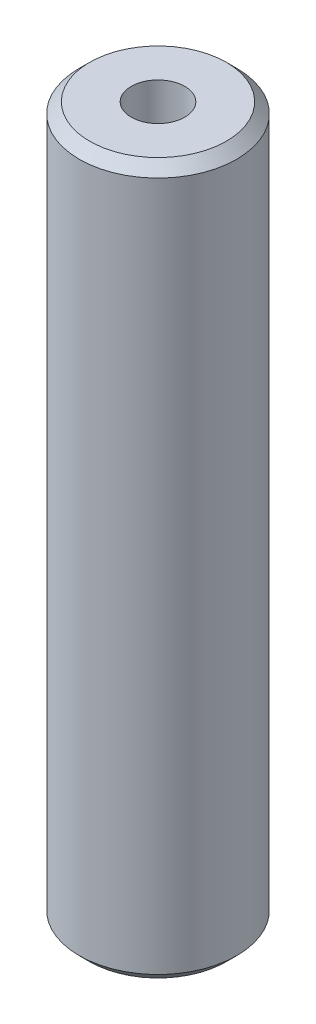
ISO-10303-21;
HEADER;
FILE_DESCRIPTION(('STEP AP214'),'2;1');
FILE_NAME('part.step','',(''),(''),'','','');
FILE_SCHEMA(('AUTOMOTIVE_DESIGN { 1 0 10303 214 1 1 1 1 }'));
ENDSEC;
DATA;
#1=APPLICATION_CONTEXT('core data for automotive mechanical design processes');
#2=APPLICATION_PROTOCOL_DEFINITION('international standard','automotive_design',2000,#1);
#3=PRODUCT_CONTEXT('',#1,'mechanical');
#4=PRODUCT('Part','Part','',(#3));
#5=PRODUCT_RELATED_PRODUCT_CATEGORY('part','',(#4));
#6=PRODUCT_DEFINITION_FORMATION('','',#4);
#7=PRODUCT_DEFINITION_CONTEXT('part definition',#1,'design');
#8=PRODUCT_DEFINITION('design','',#6,#7);
#9=PRODUCT_DEFINITION_SHAPE('','',#8);
#10=(LENGTH_UNIT() NAMED_UNIT(*) SI_UNIT(.MILLI.,.METRE.));
#11=(NAMED_UNIT(*) PLANE_ANGLE_UNIT() SI_UNIT($,.RADIAN.));
#12=(NAMED_UNIT(*) SI_UNIT($,.STERADIAN.) SOLID_ANGLE_UNIT());
#13=UNCERTAINTY_MEASURE_WITH_UNIT(LENGTH_MEASURE(1.E-05),#10,'distance_accuracy_value','');
#14=(GEOMETRIC_REPRESENTATION_CONTEXT(3) GLOBAL_UNCERTAINTY_ASSIGNED_CONTEXT((#13)) GLOBAL_UNIT_ASSIGNED_CONTEXT((#10,
#11,#12)) REPRESENTATION_CONTEXT('',''));
#15=CARTESIAN_POINT('',(0.,0.,0.));
#16=DIRECTION('',(0.,0.,1.));
#17=DIRECTION('',(1.,0.,0.));
#18=AXIS2_PLACEMENT_3D('',#15,#16,#17);
#19=CARTESIAN_POINT('',(0.,383.328716124654,0.));
#20=DIRECTION('',(0.,-1.,0.));
#21=DIRECTION('',(0.,0.,-1.));
#22=AXIS2_PLACEMENT_3D('',#19,#20,#21);
#23=CYLINDRICAL_SURFACE('',#22,42.5);
#24=CARTESIAN_POINT('',(0.,377.711191490989,0.));
#25=DIRECTION('',(0.,1.,0.));
#26=DIRECTION('',(0.,0.,1.));
#27=AXIS2_PLACEMENT_3D('',#24,#25,#26);
#28=CIRCLE('',#27,42.5);
#29=CARTESIAN_POINT('',(0.,377.711191490989,-42.5));
#30=VERTEX_POINT('',#29);
#31=EDGE_CURVE('E50',#30,#30,#28,.F.);
#32=CARTESIAN_POINT('',(0.,5.61752463366483,0.));
#33=DIRECTION('',(0.,1.,0.));
#34=DIRECTION('',(0.,0.,1.));
#35=AXIS2_PLACEMENT_3D('',#32,#33,#34);
#36=CIRCLE('',#35,42.5);
#37=CARTESIAN_POINT('',(0.,5.61752463366477,-42.5));
#38=VERTEX_POINT('',#37);
#39=EDGE_CURVE('E51',#38,#38,#36,.T.);
#40=CARTESIAN_POINT('',(0.,377.711191490989,-42.5));
#41=CARTESIAN_POINT('',(0.,373.835215794558,-42.5));
#42=CARTESIAN_POINT('',(0.,369.959240098128,-42.5));
#43=CARTESIAN_POINT('',(0.,362.207288705267,-42.5));
#44=CARTESIAN_POINT('',(0.,358.331313008837,-42.5));
#45=CARTESIAN_POINT('',(0.,350.579361615976,-42.5));
#46=CARTESIAN_POINT('',(0.,346.703385919545,-42.5));
#47=CARTESIAN_POINT('',(0.,338.951434526684,-42.5));
#48=CARTESIAN_POINT('',(0.,335.075458830254,-42.5));
#49=CARTESIAN_POINT('',(0.,327.323507437393,-42.5));
#50=CARTESIAN_POINT('',(0.,323.447531740962,-42.5));
#51=CARTESIAN_POINT('',(0.,315.695580348102,-42.5));
#52=CARTESIAN_POINT('',(0.,311.819604651671,-42.5));
#53=CARTESIAN_POINT('',(0.,304.06765325881,-42.5));
#54=CARTESIAN_POINT('',(0.,300.19167756238,-42.5));
#55=CARTESIAN_POINT('',(0.,292.439726169519,-42.5));
#56=CARTESIAN_POINT('',(0.,288.563750473088,-42.5));
#57=CARTESIAN_POINT('',(0.,280.811799080227,-42.5));
#58=CARTESIAN_POINT('',(0.,276.935823383797,-42.5));
#59=CARTESIAN_POINT('',(0.,269.183871990936,-42.5));
#60=CARTESIAN_POINT('',(0.,265.307896294505,-42.5));
#61=CARTESIAN_POINT('',(0.,257.555944901645,-42.5));
#62=CARTESIAN_POINT('',(0.,253.679969205214,-42.5));
#63=CARTESIAN_POINT('',(0.,245.928017812353,-42.5));
#64=CARTESIAN_POINT('',(0.,242.052042115923,-42.5));
#65=CARTESIAN_POINT('',(0.,234.300090723062,-42.5));
#66=CARTESIAN_POINT('',(0.,230.424115026631,-42.5));
#67=CARTESIAN_POINT('',(0.,222.67216363377,-42.5));
#68=CARTESIAN_POINT('',(0.,218.79618793734,-42.5));
#69=CARTESIAN_POINT('',(0.,211.044236544479,-42.5));
#70=CARTESIAN_POINT('',(0.,207.168260848049,-42.5));
#71=CARTESIAN_POINT('',(0.,199.416309455188,-42.5));
#72=CARTESIAN_POINT('',(0.,195.540333758757,-42.5));
#73=CARTESIAN_POINT('',(0.,187.788382365896,-42.5));
#74=CARTESIAN_POINT('',(0.,183.912406669466,-42.5));
#75=CARTESIAN_POINT('',(0.,176.160455276605,-42.5));
#76=CARTESIAN_POINT('',(0.,172.284479580175,-42.5));
#77=CARTESIAN_POINT('',(0.,164.532528187314,-42.5));
#78=CARTESIAN_POINT('',(0.,160.656552490883,-42.5));
#79=CARTESIAN_POINT('',(0.,152.904601098022,-42.5));
#80=CARTESIAN_POINT('',(0.,149.028625401592,-42.5));
#81=CARTESIAN_POINT('',(0.,141.276674008731,-42.5));
#82=CARTESIAN_POINT('',(0.,137.4006983123,-42.5));
#83=CARTESIAN_POINT('',(0.,129.648746919439,-42.5));
#84=CARTESIAN_POINT('',(0.,125.772771223009,-42.5));
#85=CARTESIAN_POINT('',(0.,118.020819830148,-42.5));
#86=CARTESIAN_POINT('',(0.,114.144844133718,-42.5));
#87=CARTESIAN_POINT('',(0.,106.392892740857,-42.5));
#88=CARTESIAN_POINT('',(0.,102.516917044426,-42.5));
#89=CARTESIAN_POINT('',(0.,94.7649656515653,-42.5));
#90=CARTESIAN_POINT('',(0.,90.8889899551348,-42.5));
#91=CARTESIAN_POINT('',(0.,83.1370385622739,-42.5));
#92=CARTESIAN_POINT('',(0.,79.2610628658435,-42.5));
#93=CARTESIAN_POINT('',(0.,71.5091114729825,-42.5));
#94=CARTESIAN_POINT('',(0.,67.6331357765521,-42.5));
#95=CARTESIAN_POINT('',(0.,59.8811843836911,-42.5));
#96=CARTESIAN_POINT('',(0.,56.0052086872607,-42.5));
#97=CARTESIAN_POINT('',(0.,48.2532572943998,-42.5));
#98=CARTESIAN_POINT('',(0.,44.3772815979693,-42.5));
#99=CARTESIAN_POINT('',(0.,36.6253302051084,-42.5));
#100=CARTESIAN_POINT('',(0.,32.749354508678,-42.5));
#101=CARTESIAN_POINT('',(0.,24.9974031158171,-42.5));
#102=CARTESIAN_POINT('',(0.,21.1214274193866,-42.5));
#103=CARTESIAN_POINT('',(0.,13.3694760265257,-42.5));
#104=CARTESIAN_POINT('',(0.,9.49350033009524,-42.5));
#105=CARTESIAN_POINT('',(0.,5.61752463366477,-42.5));
#106=B_SPLINE_CURVE_WITH_KNOTS('',3,(#40,#41,#42,#43,#44,#45,#46,#47,#48,#49,#50,#51,#52,#53,
#54,#55,#56,#57,#58,#59,#60,#61,#62,#63,#64,#65,#66,#67,#68,#69,#70,#71,#72,#73,#74,#75,#76,#77,
#78,#79,#80,#81,#82,#83,#84,#85,#86,#87,#88,#89,#90,#91,#92,#93,#94,#95,#96,#97,#98,#99,#100,
#101,#102,#103,#104,#105),.UNSPECIFIED.,.F.,.F.,(4,2,2,2,2,2,2,2,2,2,2,2,2,2,2,2,2,2,2,2,2,2,2,
2,2,2,2,2,2,2,2,2,4),(0.,11.6279270892913,23.2558541785827,34.8837812678741,46.5117083571655,
58.1396354464568,69.7675625357482,81.3954896250396,93.023416714331,104.651343803622,
116.279270892914,127.907197982205,139.535125071497,151.163052160788,162.790979250079,
174.418906339371,186.046833428662,197.674760517953,209.302687607245,220.930614696536,
232.558541785828,244.186468875119,255.81439596441,267.442323053702,279.070250142993,
290.698177232284,302.326104321576,313.954031410867,325.581958500159,337.20988558945,
348.837812678741,360.465739768033,372.093666857324),.UNSPECIFIED.);
#107=EDGE_CURVE('BSEAM39',#30,#38,#106,.T.);
#108=ORIENTED_EDGE('',*,*,#31,.T.);
#109=ORIENTED_EDGE('',*,*,#39,.T.);
#110=ORIENTED_EDGE('',*,*,#107,.T.);
#111=ORIENTED_EDGE('',*,*,#107,.F.);
#112=EDGE_LOOP('',(#108,#110,#109,#111));
#113=FACE_BOUND('',#112,.T.);
#114=ADVANCED_FACE('F39',(#113),#23,.T.);
#115=CARTESIAN_POINT('',(0.,383.328716124654,0.));
#116=DIRECTION('',(0.,1.,0.));
#117=DIRECTION('',(0.,0.,1.));
#118=AXIS2_PLACEMENT_3D('',#115,#116,#117);
#119=PLANE('',#118);
#120=CARTESIAN_POINT('',(0.,383.328716124654,0.));
#121=DIRECTION('',(0.,1.,0.));
#122=DIRECTION('',(0.,0.,1.));
#123=AXIS2_PLACEMENT_3D('',#120,#121,#122);
#124=CIRCLE('',#123,36.8824753663352);
#125=CARTESIAN_POINT('',(0.,383.328716124654,-36.8824753663352));
#126=VERTEX_POINT('',#125);
#127=EDGE_CURVE('E54',#126,#126,#124,.T.);
#128=ORIENTED_EDGE('',*,*,#127,.T.);
#129=EDGE_LOOP('',(#128));
#130=FACE_BOUND('',#129,.T.);
#131=CARTESIAN_POINT('',(0.,383.328716124654,0.));
#132=DIRECTION('',(0.,1.,0.));
#133=DIRECTION('',(0.,0.,1.));
#134=AXIS2_PLACEMENT_3D('',#131,#132,#133);
#135=CIRCLE('',#134,14.4369700554895);
#136=CARTESIAN_POINT('',(0.,383.328716124654,14.4369700554895));
#137=VERTEX_POINT('',#136);
#138=EDGE_CURVE('E58',#137,#137,#135,.T.);
#139=ORIENTED_EDGE('',*,*,#138,.F.);
#140=EDGE_LOOP('',(#139));
#141=FACE_BOUND('',#140,.T.);
#142=ADVANCED_FACE('F69',(#130,#141),#119,.T.);
#143=CARTESIAN_POINT('',(0.,0.,0.));
#144=DIRECTION('',(0.,1.,0.));
#145=DIRECTION('',(0.,0.,1.));
#146=AXIS2_PLACEMENT_3D('',#143,#144,#145);
#147=PLANE('',#146);
#148=CARTESIAN_POINT('',(0.,0.,0.));
#149=DIRECTION('',(0.,1.,0.));
#150=DIRECTION('',(0.,0.,1.));
#151=AXIS2_PLACEMENT_3D('',#148,#149,#150);
#152=CIRCLE('',#151,36.8824753663351);
#153=CARTESIAN_POINT('',(0.,0.,36.8824753663351));
#154=VERTEX_POINT('',#153);
#155=EDGE_CURVE('E10',#154,#154,#152,.F.);
#156=ORIENTED_EDGE('',*,*,#155,.T.);
#157=EDGE_LOOP('',(#156));
#158=FACE_BOUND('',#157,.T.);
#159=CARTESIAN_POINT('',(0.,0.,0.));
#160=DIRECTION('',(0.,1.,0.));
#161=DIRECTION('',(0.,0.,1.));
#162=AXIS2_PLACEMENT_3D('',#159,#160,#161);
#163=CIRCLE('',#162,14.4369700554895);
#164=CARTESIAN_POINT('',(0.,0.,14.4369700554895));
#165=VERTEX_POINT('',#164);
#166=EDGE_CURVE('E63',#165,#165,#163,.T.);
#167=ORIENTED_EDGE('',*,*,#166,.T.);
#168=EDGE_LOOP('',(#167));
#169=FACE_BOUND('',#168,.T.);
#170=ADVANCED_FACE('F75',(#158,#169),#147,.F.);
#171=CARTESIAN_POINT('',(0.,383.328716124654,0.));
#172=DIRECTION('',(0.,-1.,0.));
#173=DIRECTION('',(0.,0.,-1.));
#174=AXIS2_PLACEMENT_3D('',#171,#172,#173);
#175=CYLINDRICAL_SURFACE('',#174,14.4369700554895);
#176=ORIENTED_EDGE('',*,*,#138,.T.);
#177=EDGE_LOOP('',(#176));
#178=FACE_BOUND('',#177,.T.);
#179=ORIENTED_EDGE('',*,*,#166,.F.);
#180=EDGE_LOOP('',(#179));
#181=FACE_BOUND('',#180,.T.);
#182=ADVANCED_FACE('F70',(#178,#181),#175,.F.);
#183=CARTESIAN_POINT('',(0.,383.328716124654,0.));
#184=DIRECTION('',(0.,-1.,0.));
#185=DIRECTION('',(0.,0.,-1.));
#186=AXIS2_PLACEMENT_3D('',#183,#184,#185);
#187=CONICAL_SURFACE('',#186,36.8824753663352,0.785398163397446);
#188=CARTESIAN_POINT('',(0.,377.711191490989,-42.5));
#189=CARTESIAN_POINT('',(0.,377.76970737259,-42.4414841183994));
#190=CARTESIAN_POINT('',(0.,377.82822325419,-42.3829682367987));
#191=CARTESIAN_POINT('',(0.,377.945255017392,-42.2659364735973));
#192=CARTESIAN_POINT('',(0.,378.003770898992,-42.2074205919967));
#193=CARTESIAN_POINT('',(0.,378.120802662194,-42.0903888287953));
#194=CARTESIAN_POINT('',(0.,378.179318543794,-42.0318729471946));
#195=CARTESIAN_POINT('',(0.,378.296350306996,-41.9148411839933));
#196=CARTESIAN_POINT('',(0.,378.354866188596,-41.8563253023926));
#197=CARTESIAN_POINT('',(0.,378.471897951798,-41.7392935391913));
#198=CARTESIAN_POINT('',(0.,378.530413833398,-41.6807776575906));
#199=CARTESIAN_POINT('',(0.,378.6474455966,-41.5637458943892));
#200=CARTESIAN_POINT('',(0.,378.7059614782,-41.5052300127886));
#201=CARTESIAN_POINT('',(0.,378.822993241402,-41.3881982495872));
#202=CARTESIAN_POINT('',(0.,378.881509123002,-41.3296823679865));
#203=CARTESIAN_POINT('',(0.,378.998540886204,-41.2126506047852));
#204=CARTESIAN_POINT('',(0.,379.057056767804,-41.1541347231845));
#205=CARTESIAN_POINT('',(0.,379.174088531006,-41.0371029599832));
#206=CARTESIAN_POINT('',(0.,379.232604412606,-40.9785870783825));
#207=CARTESIAN_POINT('',(0.,379.349636175808,-40.8615553151811));
#208=CARTESIAN_POINT('',(0.,379.408152057408,-40.8030394335805));
#209=CARTESIAN_POINT('',(0.,379.52518382061,-40.6860076703791));
#210=CARTESIAN_POINT('',(0.,379.58369970221,-40.6274917887784));
#211=CARTESIAN_POINT('',(0.,379.700731465412,-40.5104600255771));
#212=CARTESIAN_POINT('',(0.,379.759247347013,-40.4519441439764));
#213=CARTESIAN_POINT('',(0.,379.876279110214,-40.3349123807751));
#214=CARTESIAN_POINT('',(0.,379.934794991815,-40.2763964991744));
#215=CARTESIAN_POINT('',(0.,380.051826755016,-40.159364735973));
#216=CARTESIAN_POINT('',(0.,380.110342636617,-40.1008488543724));
#217=CARTESIAN_POINT('',(0.,380.227374399818,-39.983817091171));
#218=CARTESIAN_POINT('',(0.,380.285890281419,-39.9253012095703));
#219=CARTESIAN_POINT('',(0.,380.40292204462,-39.808269446369));
#220=CARTESIAN_POINT('',(0.,380.461437926221,-39.7497535647683));
#221=CARTESIAN_POINT('',(0.,380.578469689422,-39.632721801567));
#222=CARTESIAN_POINT('',(0.,380.636985571023,-39.5742059199663));
#223=CARTESIAN_POINT('',(0.,380.754017334224,-39.4571741567649));
#224=CARTESIAN_POINT('',(0.,380.812533215825,-39.3986582751643));
#225=CARTESIAN_POINT('',(0.,380.929564979026,-39.2816265119629));
#226=CARTESIAN_POINT('',(0.,380.988080860627,-39.2231106303622));
#227=CARTESIAN_POINT('',(0.,381.105112623828,-39.1060788671609));
#228=CARTESIAN_POINT('',(0.,381.163628505429,-39.0475629855602));
#229=CARTESIAN_POINT('',(0.,381.28066026863,-38.9305312223589));
#230=CARTESIAN_POINT('',(0.,381.339176150231,-38.8720153407582));
#231=CARTESIAN_POINT('',(0.,381.456207913432,-38.7549835775568));
#232=CARTESIAN_POINT('',(0.,381.514723795033,-38.6964676959562));
#233=CARTESIAN_POINT('',(0.,381.631755558234,-38.5794359327548));
#234=CARTESIAN_POINT('',(0.,381.690271439835,-38.5209200511541));
#235=CARTESIAN_POINT('',(0.,381.807303203036,-38.4038882879528));
#236=CARTESIAN_POINT('',(0.,381.865819084637,-38.3453724063521));
#237=CARTESIAN_POINT('',(0.,381.982850847838,-38.2283406431508));
#238=CARTESIAN_POINT('',(0.,382.041366729439,-38.1698247615501));
#239=CARTESIAN_POINT('',(0.,382.15839849264,-38.0527929983487));
#240=CARTESIAN_POINT('',(0.,382.216914374241,-37.9942771167481));
#241=CARTESIAN_POINT('',(0.,382.333946137442,-37.8772453535467));
#242=CARTESIAN_POINT('',(0.,382.392462019043,-37.818729471946));
#243=CARTESIAN_POINT('',(0.,382.509493782244,-37.7016977087447));
#244=CARTESIAN_POINT('',(0.,382.568009663845,-37.643181827144));
#245=CARTESIAN_POINT('',(0.,382.685041427046,-37.5261500639427));
#246=CARTESIAN_POINT('',(0.,382.743557308647,-37.467634182342));
#247=CARTESIAN_POINT('',(0.,382.860589071848,-37.3506024191406));
#248=CARTESIAN_POINT('',(0.,382.919104953449,-37.29208653754));
#249=CARTESIAN_POINT('',(0.,383.03613671665,-37.1750547743386));
#250=CARTESIAN_POINT('',(0.,383.094652598251,-37.1165388927379));
#251=CARTESIAN_POINT('',(0.,383.211684361452,-36.9995071295366));
#252=CARTESIAN_POINT('',(0.,383.270200243053,-36.9409912479359));
#253=CARTESIAN_POINT('',(0.,383.328716124654,-36.8824753663352));
#254=B_SPLINE_CURVE_WITH_KNOTS('',3,(#188,#189,#190,#191,#192,#193,#194,#195,#196,#197,#198,
#199,#200,#201,#202,#203,#204,#205,#206,#207,#208,#209,#210,#211,#212,#213,#214,#215,#216,#217,
#218,#219,#220,#221,#222,#223,#224,#225,#226,#227,#228,#229,#230,#231,#232,#233,#234,#235,#236,
#237,#238,#239,#240,#241,#242,#243,#244,#245,#246,#247,#248,#249,#250,#251,#252,#253),
.UNSPECIFIED.,.F.,.F.,(4,2,2,2,2,2,2,2,2,2,2,2,2,2,2,2,2,2,2,2,2,2,2,2,2,2,2,2,2,2,2,2,4),(0.,
0.24826186012165,0.496523720243345,0.744785580365034,0.99304744048669,1.24130930060838,
1.48957116073007,1.73783302085172,1.98609488097341,2.2343567410951,2.48261860121676,
2.73088046133845,2.97914232146014,3.22740418158179,3.47566604170348,3.72392790182518,
3.97218976194687,4.22045162206852,4.46871348219021,4.7169753423119,4.96523720243356,
5.21349906255525,5.46176092267694,5.71002278279859,5.95828464292028,6.20654650304197,
6.45480836316362,6.70307022328531,6.951332083407,7.19959394352866,7.44785580365035,
7.69611766377204,7.94437952389373),.UNSPECIFIED.);
#255=EDGE_CURVE('BSEAM81',#30,#126,#254,.T.);
#256=ORIENTED_EDGE('',*,*,#31,.F.);
#257=ORIENTED_EDGE('',*,*,#127,.F.);
#258=ORIENTED_EDGE('',*,*,#255,.T.);
#259=ORIENTED_EDGE('',*,*,#255,.F.);
#260=EDGE_LOOP('',(#256,#258,#257,#259));
#261=FACE_BOUND('',#260,.T.);
#262=ADVANCED_FACE('F81',(#261),#187,.T.);
#263=CARTESIAN_POINT('',(0.,5.61752463366483,0.));
#264=DIRECTION('',(0.,1.,0.));
#265=DIRECTION('',(0.,0.,1.));
#266=AXIS2_PLACEMENT_3D('',#263,#264,#265);
#267=CONICAL_SURFACE('',#266,42.5,0.785398163397453);
#268=ORIENTED_EDGE('',*,*,#155,.F.);
#269=EDGE_LOOP('',(#268));
#270=FACE_BOUND('',#269,.T.);
#271=ORIENTED_EDGE('',*,*,#39,.F.);
#272=EDGE_LOOP('',(#271));
#273=FACE_BOUND('',#272,.T.);
#274=ADVANCED_FACE('F45',(#270,#273),#267,.T.);
#275=CLOSED_SHELL('',(#114,#142,#170,#182,#262,#274));
#276=MANIFOLD_SOLID_BREP('B2',#275);
#277=ADVANCED_BREP_SHAPE_REPRESENTATION('',(#18,#276),#14);
#278=SHAPE_DEFINITION_REPRESENTATION(#9,#277);
ENDSEC;
END-ISO-10303-21;
